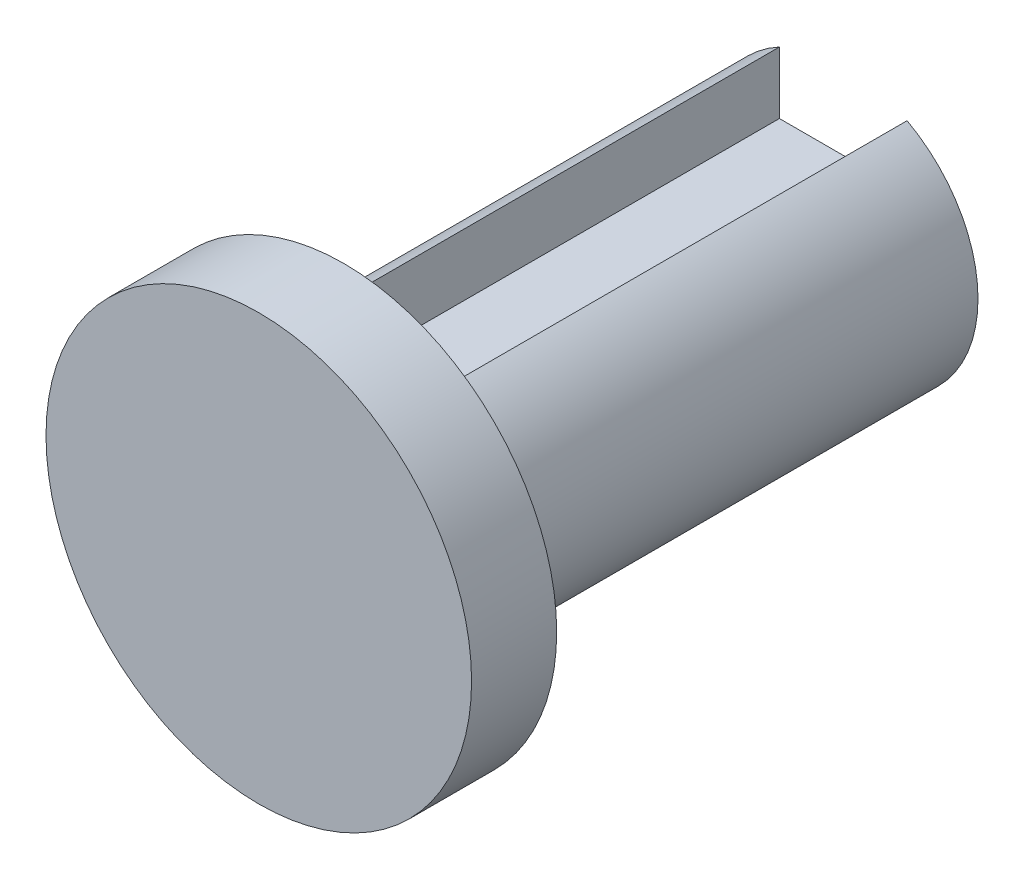
ISO-10303-21;
HEADER;
FILE_DESCRIPTION(('STEP AP214'),'2;1');
FILE_NAME('part.step','',(''),(''),'','','');
FILE_SCHEMA(('AUTOMOTIVE_DESIGN { 1 0 10303 214 1 1 1 1 }'));
ENDSEC;
DATA;
#1=APPLICATION_CONTEXT('core data for automotive mechanical design processes');
#2=APPLICATION_PROTOCOL_DEFINITION('international standard','automotive_design',2000,#1);
#3=PRODUCT_CONTEXT('',#1,'mechanical');
#4=PRODUCT('Part','Part','',(#3));
#5=PRODUCT_RELATED_PRODUCT_CATEGORY('part','',(#4));
#6=PRODUCT_DEFINITION_FORMATION('','',#4);
#7=PRODUCT_DEFINITION_CONTEXT('part definition',#1,'design');
#8=PRODUCT_DEFINITION('design','',#6,#7);
#9=PRODUCT_DEFINITION_SHAPE('','',#8);
#10=(LENGTH_UNIT() NAMED_UNIT(*) SI_UNIT(.MILLI.,.METRE.));
#11=(NAMED_UNIT(*) PLANE_ANGLE_UNIT() SI_UNIT($,.RADIAN.));
#12=(NAMED_UNIT(*) SI_UNIT($,.STERADIAN.) SOLID_ANGLE_UNIT());
#13=UNCERTAINTY_MEASURE_WITH_UNIT(LENGTH_MEASURE(1.E-05),#10,'distance_accuracy_value','');
#14=(GEOMETRIC_REPRESENTATION_CONTEXT(3) GLOBAL_UNCERTAINTY_ASSIGNED_CONTEXT((#13)) GLOBAL_UNIT_ASSIGNED_CONTEXT((#10,
#11,#12)) REPRESENTATION_CONTEXT('',''));
#15=CARTESIAN_POINT('',(0.,0.,0.));
#16=DIRECTION('',(0.,0.,1.));
#17=DIRECTION('',(1.,0.,0.));
#18=AXIS2_PLACEMENT_3D('',#15,#16,#17);
#19=CARTESIAN_POINT('',(0.,0.,6.));
#20=DIRECTION('',(0.,0.,-1.));
#21=DIRECTION('',(-1.,0.,0.));
#22=AXIS2_PLACEMENT_3D('',#19,#20,#21);
#23=CYLINDRICAL_SURFACE('',#22,15.);
#24=CARTESIAN_POINT('',(0.,0.,6.));
#25=DIRECTION('',(0.,0.,1.));
#26=DIRECTION('',(1.,0.,0.));
#27=AXIS2_PLACEMENT_3D('',#24,#25,#26);
#28=CIRCLE('',#27,15.);
#29=CARTESIAN_POINT('',(15.,0.,6.));
#30=VERTEX_POINT('',#29);
#31=EDGE_CURVE('E11',#30,#30,#28,.T.);
#32=ORIENTED_EDGE('',*,*,#31,.F.);
#33=EDGE_LOOP('',(#32));
#34=FACE_BOUND('',#33,.T.);
#35=CARTESIAN_POINT('',(0.,0.,0.));
#36=DIRECTION('',(0.,0.,1.));
#37=DIRECTION('',(1.,0.,0.));
#38=AXIS2_PLACEMENT_3D('',#35,#36,#37);
#39=CIRCLE('',#38,15.);
#40=CARTESIAN_POINT('',(15.,0.,0.));
#41=VERTEX_POINT('',#40);
#42=EDGE_CURVE('E37',#41,#41,#39,.T.);
#43=ORIENTED_EDGE('',*,*,#42,.T.);
#44=EDGE_LOOP('',(#43));
#45=FACE_BOUND('',#44,.T.);
#46=ADVANCED_FACE('F34',(#34,#45),#23,.T.);
#47=CARTESIAN_POINT('',(0.,0.,6.));
#48=DIRECTION('',(0.,0.,1.));
#49=DIRECTION('',(1.,0.,0.));
#50=AXIS2_PLACEMENT_3D('',#47,#48,#49);
#51=PLANE('',#50);
#52=ORIENTED_EDGE('',*,*,#31,.T.);
#53=EDGE_LOOP('',(#52));
#54=FACE_BOUND('',#53,.T.);
#55=ADVANCED_FACE('F126',(#54),#51,.T.);
#56=CARTESIAN_POINT('',(0.,0.,0.));
#57=DIRECTION('',(0.,0.,1.));
#58=DIRECTION('',(1.,0.,0.));
#59=AXIS2_PLACEMENT_3D('',#56,#57,#58);
#60=PLANE('',#59);
#61=DIRECTION('',(-1.,0.,0.));
#62=VECTOR('',#61,1.);
#63=CARTESIAN_POINT('',(0.,4.,0.));
#64=LINE('',#63,#62);
#65=CARTESIAN_POINT('',(4.5,4.,0.));
#66=VERTEX_POINT('',#65);
#67=CARTESIAN_POINT('',(-4.5,4.,0.));
#68=VERTEX_POINT('',#67);
#69=EDGE_CURVE('E98',#66,#68,#64,.T.);
#70=ORIENTED_EDGE('',*,*,#69,.T.);
#71=DIRECTION('',(0.,1.,0.));
#72=VECTOR('',#71,1.);
#73=CARTESIAN_POINT('',(-4.5,0.,0.));
#74=LINE('',#73,#72);
#75=CARTESIAN_POINT('',(-4.5,8.36660026534076,0.));
#76=VERTEX_POINT('',#75);
#77=EDGE_CURVE('E48',#68,#76,#74,.T.);
#78=ORIENTED_EDGE('',*,*,#77,.T.);
#79=CARTESIAN_POINT('',(0.,0.,0.));
#80=DIRECTION('',(0.,0.,1.));
#81=DIRECTION('',(1.,0.,0.));
#82=AXIS2_PLACEMENT_3D('',#79,#80,#81);
#83=CIRCLE('',#82,9.5);
#84=CARTESIAN_POINT('',(4.5,8.36660026534075,0.));
#85=VERTEX_POINT('',#84);
#86=EDGE_CURVE('E103',#76,#85,#83,.T.);
#87=ORIENTED_EDGE('',*,*,#86,.T.);
#88=DIRECTION('',(0.,1.,0.));
#89=VECTOR('',#88,1.);
#90=CARTESIAN_POINT('',(4.5,0.,0.));
#91=LINE('',#90,#89);
#92=EDGE_CURVE('E92',#66,#85,#91,.T.);
#93=ORIENTED_EDGE('',*,*,#92,.F.);
#94=EDGE_LOOP('',(#70,#78,#87,#93));
#95=FACE_BOUND('',#94,.T.);
#96=ORIENTED_EDGE('',*,*,#42,.F.);
#97=EDGE_LOOP('',(#96));
#98=FACE_BOUND('',#97,.T.);
#99=ADVANCED_FACE('F112',(#95,#98),#60,.F.);
#100=CARTESIAN_POINT('',(-4.5,0.,-35.2));
#101=DIRECTION('',(1.,0.,0.));
#102=DIRECTION('',(0.,0.,-1.));
#103=AXIS2_PLACEMENT_3D('',#100,#101,#102);
#104=PLANE('',#103);
#105=ORIENTED_EDGE('',*,*,#77,.F.);
#106=DIRECTION('',(0.,0.,1.));
#107=VECTOR('',#106,1.);
#108=CARTESIAN_POINT('',(-4.5,4.,-35.2));
#109=LINE('',#108,#107);
#110=CARTESIAN_POINT('',(-4.5,4.,-35.2));
#111=VERTEX_POINT('',#110);
#112=EDGE_CURVE('E53',#111,#68,#109,.T.);
#113=ORIENTED_EDGE('',*,*,#112,.F.);
#114=DIRECTION('',(0.,1.,0.));
#115=VECTOR('',#114,1.);
#116=CARTESIAN_POINT('',(-4.5,0.,-35.2));
#117=LINE('',#116,#115);
#118=CARTESIAN_POINT('',(-4.5,8.36660026534076,-35.2));
#119=VERTEX_POINT('',#118);
#120=EDGE_CURVE('E96',#111,#119,#117,.T.);
#121=ORIENTED_EDGE('',*,*,#120,.T.);
#122=DIRECTION('',(0.,0.,1.));
#123=VECTOR('',#122,1.);
#124=CARTESIAN_POINT('',(-4.5,8.36660026534076,-35.2));
#125=LINE('',#124,#123);
#126=EDGE_CURVE('E77',#119,#76,#125,.T.);
#127=ORIENTED_EDGE('',*,*,#126,.T.);
#128=EDGE_LOOP('',(#105,#113,#121,#127));
#129=FACE_BOUND('',#128,.T.);
#130=ADVANCED_FACE('F110',(#129),#104,.T.);
#131=CARTESIAN_POINT('',(0.,4.,-35.2));
#132=DIRECTION('',(0.,1.,0.));
#133=DIRECTION('',(-1.,0.,0.));
#134=AXIS2_PLACEMENT_3D('',#131,#132,#133);
#135=PLANE('',#134);
#136=ORIENTED_EDGE('',*,*,#69,.F.);
#137=DIRECTION('',(0.,0.,1.));
#138=VECTOR('',#137,1.);
#139=CARTESIAN_POINT('',(4.5,4.,-35.2));
#140=LINE('',#139,#138);
#141=CARTESIAN_POINT('',(4.5,4.,-35.2));
#142=VERTEX_POINT('',#141);
#143=EDGE_CURVE('E70',#142,#66,#140,.T.);
#144=ORIENTED_EDGE('',*,*,#143,.F.);
#145=DIRECTION('',(-1.,0.,0.));
#146=VECTOR('',#145,1.);
#147=CARTESIAN_POINT('',(0.,4.,-35.2));
#148=LINE('',#147,#146);
#149=EDGE_CURVE('E87',#142,#111,#148,.T.);
#150=ORIENTED_EDGE('',*,*,#149,.T.);
#151=ORIENTED_EDGE('',*,*,#112,.T.);
#152=EDGE_LOOP('',(#136,#144,#150,#151));
#153=FACE_BOUND('',#152,.T.);
#154=ADVANCED_FACE('F115',(#153),#135,.T.);
#155=CARTESIAN_POINT('',(4.5,0.,-35.2));
#156=DIRECTION('',(1.,0.,0.));
#157=DIRECTION('',(0.,0.,-1.));
#158=AXIS2_PLACEMENT_3D('',#155,#156,#157);
#159=PLANE('',#158);
#160=ORIENTED_EDGE('',*,*,#92,.T.);
#161=DIRECTION('',(0.,0.,1.));
#162=VECTOR('',#161,1.);
#163=CARTESIAN_POINT('',(4.5,8.36660026534075,-35.2));
#164=LINE('',#163,#162);
#165=CARTESIAN_POINT('',(4.5,8.36660026534075,-35.2));
#166=VERTEX_POINT('',#165);
#167=EDGE_CURVE('E89',#166,#85,#164,.T.);
#168=ORIENTED_EDGE('',*,*,#167,.F.);
#169=DIRECTION('',(0.,1.,0.));
#170=VECTOR('',#169,1.);
#171=CARTESIAN_POINT('',(4.5,0.,-35.2));
#172=LINE('',#171,#170);
#173=EDGE_CURVE('E82',#142,#166,#172,.T.);
#174=ORIENTED_EDGE('',*,*,#173,.F.);
#175=ORIENTED_EDGE('',*,*,#143,.T.);
#176=EDGE_LOOP('',(#160,#168,#174,#175));
#177=FACE_BOUND('',#176,.T.);
#178=ADVANCED_FACE('F90',(#177),#159,.F.);
#179=CARTESIAN_POINT('',(0.,0.,-35.2));
#180=DIRECTION('',(0.,0.,1.));
#181=DIRECTION('',(1.,0.,0.));
#182=AXIS2_PLACEMENT_3D('',#179,#180,#181);
#183=CYLINDRICAL_SURFACE('',#182,9.5);
#184=ORIENTED_EDGE('',*,*,#86,.F.);
#185=ORIENTED_EDGE('',*,*,#126,.F.);
#186=CARTESIAN_POINT('',(0.,0.,-35.2));
#187=DIRECTION('',(0.,0.,1.));
#188=DIRECTION('',(1.,0.,0.));
#189=AXIS2_PLACEMENT_3D('',#186,#187,#188);
#190=CIRCLE('',#189,9.5);
#191=EDGE_CURVE('E85',#119,#166,#190,.T.);
#192=ORIENTED_EDGE('',*,*,#191,.T.);
#193=ORIENTED_EDGE('',*,*,#167,.T.);
#194=EDGE_LOOP('',(#184,#185,#192,#193));
#195=FACE_BOUND('',#194,.T.);
#196=ADVANCED_FACE('F95',(#195),#183,.T.);
#197=CARTESIAN_POINT('',(0.,0.,-35.2));
#198=DIRECTION('',(0.,0.,1.));
#199=DIRECTION('',(1.,0.,0.));
#200=AXIS2_PLACEMENT_3D('',#197,#198,#199);
#201=PLANE('',#200);
#202=ORIENTED_EDGE('',*,*,#120,.F.);
#203=ORIENTED_EDGE('',*,*,#149,.F.);
#204=ORIENTED_EDGE('',*,*,#173,.T.);
#205=ORIENTED_EDGE('',*,*,#191,.F.);
#206=EDGE_LOOP('',(#202,#203,#204,#205));
#207=FACE_BOUND('',#206,.T.);
#208=ADVANCED_FACE('F84',(#207),#201,.F.);
#209=CLOSED_SHELL('',(#46,#55,#99,#130,#154,#178,#196,#208));
#210=MANIFOLD_SOLID_BREP('B2',#209);
#211=ADVANCED_BREP_SHAPE_REPRESENTATION('',(#18,#210),#14);
#212=SHAPE_DEFINITION_REPRESENTATION(#9,#211);
ENDSEC;
END-ISO-10303-21;
